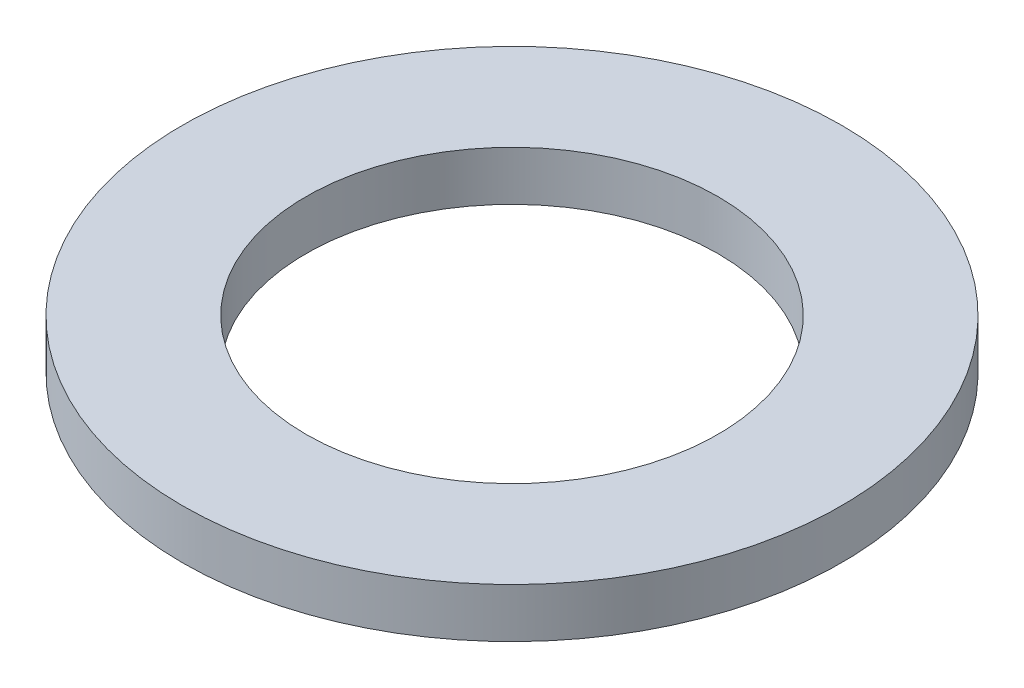
ISO-10303-21;
HEADER;
FILE_DESCRIPTION(('STEP AP214'),'2;1');
FILE_NAME('part.step','',(''),(''),'','','');
FILE_SCHEMA(('AUTOMOTIVE_DESIGN { 1 0 10303 214 1 1 1 1 }'));
ENDSEC;
DATA;
#1=APPLICATION_CONTEXT('core data for automotive mechanical design processes');
#2=APPLICATION_PROTOCOL_DEFINITION('international standard','automotive_design',2000,#1);
#3=PRODUCT_CONTEXT('',#1,'mechanical');
#4=PRODUCT('Part','Part','',(#3));
#5=PRODUCT_RELATED_PRODUCT_CATEGORY('part','',(#4));
#6=PRODUCT_DEFINITION_FORMATION('','',#4);
#7=PRODUCT_DEFINITION_CONTEXT('part definition',#1,'design');
#8=PRODUCT_DEFINITION('design','',#6,#7);
#9=PRODUCT_DEFINITION_SHAPE('','',#8);
#10=(LENGTH_UNIT() NAMED_UNIT(*) SI_UNIT(.MILLI.,.METRE.));
#11=(NAMED_UNIT(*) PLANE_ANGLE_UNIT() SI_UNIT($,.RADIAN.));
#12=(NAMED_UNIT(*) SI_UNIT($,.STERADIAN.) SOLID_ANGLE_UNIT());
#13=UNCERTAINTY_MEASURE_WITH_UNIT(LENGTH_MEASURE(1.E-05),#10,'distance_accuracy_value','');
#14=(GEOMETRIC_REPRESENTATION_CONTEXT(3) GLOBAL_UNCERTAINTY_ASSIGNED_CONTEXT((#13)) GLOBAL_UNIT_ASSIGNED_CONTEXT((#10,
#11,#12)) REPRESENTATION_CONTEXT('',''));
#15=CARTESIAN_POINT('',(0.,0.,0.));
#16=DIRECTION('',(0.,0.,1.));
#17=DIRECTION('',(1.,0.,0.));
#18=AXIS2_PLACEMENT_3D('',#15,#16,#17);
#19=CARTESIAN_POINT('',(0.,9.,0.));
#20=DIRECTION('',(0.,-1.,0.));
#21=DIRECTION('',(0.,0.,-1.));
#22=AXIS2_PLACEMENT_3D('',#19,#20,#21);
#23=CYLINDRICAL_SURFACE('',#22,60.);
#24=CARTESIAN_POINT('',(0.,9.,0.));
#25=DIRECTION('',(0.,1.,0.));
#26=DIRECTION('',(0.,0.,1.));
#27=AXIS2_PLACEMENT_3D('',#24,#25,#26);
#28=CIRCLE('',#27,60.);
#29=CARTESIAN_POINT('',(0.,9.,60.));
#30=VERTEX_POINT('',#29);
#31=EDGE_CURVE('E10',#30,#30,#28,.T.);
#32=ORIENTED_EDGE('',*,*,#31,.F.);
#33=EDGE_LOOP('',(#32));
#34=FACE_BOUND('',#33,.T.);
#35=CARTESIAN_POINT('',(0.,0.,0.));
#36=DIRECTION('',(0.,1.,0.));
#37=DIRECTION('',(0.,0.,1.));
#38=AXIS2_PLACEMENT_3D('',#35,#36,#37);
#39=CIRCLE('',#38,60.);
#40=CARTESIAN_POINT('',(0.,0.,60.));
#41=VERTEX_POINT('',#40);
#42=EDGE_CURVE('E37',#41,#41,#39,.T.);
#43=ORIENTED_EDGE('',*,*,#42,.T.);
#44=EDGE_LOOP('',(#43));
#45=FACE_BOUND('',#44,.T.);
#46=ADVANCED_FACE('F40',(#34,#45),#23,.T.);
#47=CARTESIAN_POINT('',(0.,9.,0.));
#48=DIRECTION('',(0.,1.,0.));
#49=DIRECTION('',(0.,0.,1.));
#50=AXIS2_PLACEMENT_3D('',#47,#48,#49);
#51=PLANE('',#50);
#52=CARTESIAN_POINT('',(0.,9.,0.));
#53=DIRECTION('',(0.,1.,0.));
#54=DIRECTION('',(0.,0.,1.));
#55=AXIS2_PLACEMENT_3D('',#52,#53,#54);
#56=CIRCLE('',#55,37.5);
#57=CARTESIAN_POINT('',(0.,9.,37.5));
#58=VERTEX_POINT('',#57);
#59=EDGE_CURVE('E50',#58,#58,#56,.T.);
#60=ORIENTED_EDGE('',*,*,#59,.F.);
#61=EDGE_LOOP('',(#60));
#62=FACE_BOUND('',#61,.T.);
#63=ORIENTED_EDGE('',*,*,#31,.T.);
#64=EDGE_LOOP('',(#63));
#65=FACE_BOUND('',#64,.T.);
#66=ADVANCED_FACE('F59',(#62,#65),#51,.T.);
#67=CARTESIAN_POINT('',(0.,0.,0.));
#68=DIRECTION('',(0.,1.,0.));
#69=DIRECTION('',(0.,0.,1.));
#70=AXIS2_PLACEMENT_3D('',#67,#68,#69);
#71=PLANE('',#70);
#72=CARTESIAN_POINT('',(0.,0.,0.));
#73=DIRECTION('',(0.,1.,0.));
#74=DIRECTION('',(0.,0.,1.));
#75=AXIS2_PLACEMENT_3D('',#72,#73,#74);
#76=CIRCLE('',#75,37.5);
#77=CARTESIAN_POINT('',(0.,0.,37.5));
#78=VERTEX_POINT('',#77);
#79=EDGE_CURVE('E47',#78,#78,#76,.T.);
#80=ORIENTED_EDGE('',*,*,#79,.T.);
#81=EDGE_LOOP('',(#80));
#82=FACE_BOUND('',#81,.T.);
#83=ORIENTED_EDGE('',*,*,#42,.F.);
#84=EDGE_LOOP('',(#83));
#85=FACE_BOUND('',#84,.T.);
#86=ADVANCED_FACE('F58',(#82,#85),#71,.F.);
#87=CARTESIAN_POINT('',(0.,9.,0.));
#88=DIRECTION('',(0.,-1.,0.));
#89=DIRECTION('',(0.,0.,-1.));
#90=AXIS2_PLACEMENT_3D('',#87,#88,#89);
#91=CYLINDRICAL_SURFACE('',#90,37.5);
#92=ORIENTED_EDGE('',*,*,#59,.T.);
#93=EDGE_LOOP('',(#92));
#94=FACE_BOUND('',#93,.T.);
#95=ORIENTED_EDGE('',*,*,#79,.F.);
#96=EDGE_LOOP('',(#95));
#97=FACE_BOUND('',#96,.T.);
#98=ADVANCED_FACE('F54',(#94,#97),#91,.F.);
#99=CLOSED_SHELL('',(#46,#66,#86,#98));
#100=MANIFOLD_SOLID_BREP('B2',#99);
#101=ADVANCED_BREP_SHAPE_REPRESENTATION('',(#18,#100),#14);
#102=SHAPE_DEFINITION_REPRESENTATION(#9,#101);
ENDSEC;
END-ISO-10303-21;
